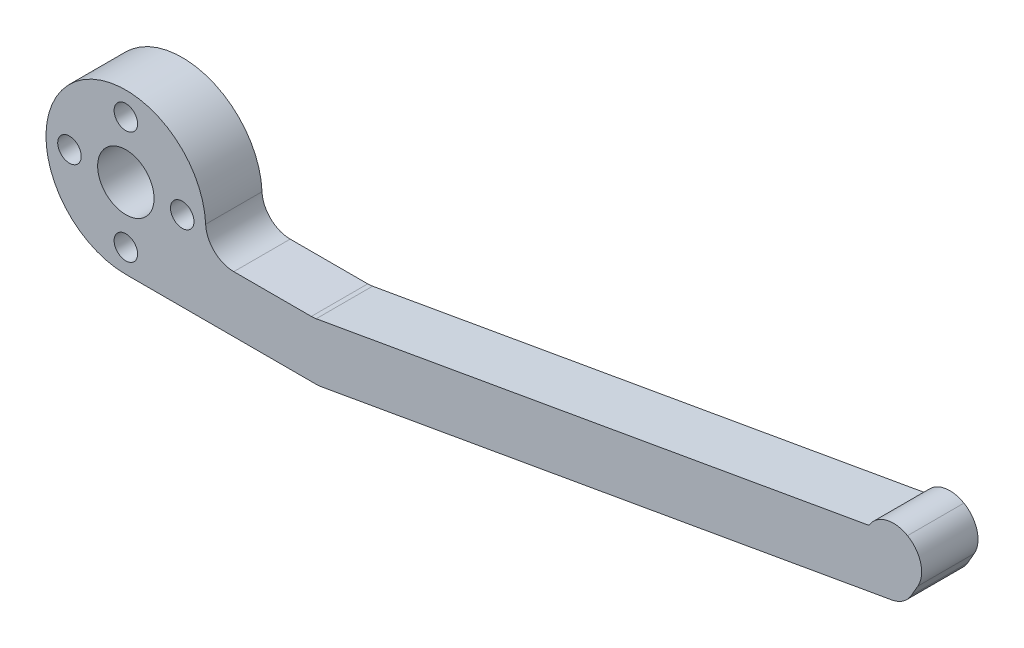
ISO-10303-21;
HEADER;
FILE_DESCRIPTION(('STEP AP214'),'2;1');
FILE_NAME('part.step','',(''),(''),'','','');
FILE_SCHEMA(('AUTOMOTIVE_DESIGN { 1 0 10303 214 1 1 1 1 }'));
ENDSEC;
DATA;
#1=APPLICATION_CONTEXT('core data for automotive mechanical design processes');
#2=APPLICATION_PROTOCOL_DEFINITION('international standard','automotive_design',2000,#1);
#3=PRODUCT_CONTEXT('',#1,'mechanical');
#4=PRODUCT('Part','Part','',(#3));
#5=PRODUCT_RELATED_PRODUCT_CATEGORY('part','',(#4));
#6=PRODUCT_DEFINITION_FORMATION('','',#4);
#7=PRODUCT_DEFINITION_CONTEXT('part definition',#1,'design');
#8=PRODUCT_DEFINITION('design','',#6,#7);
#9=PRODUCT_DEFINITION_SHAPE('','',#8);
#10=(LENGTH_UNIT() NAMED_UNIT(*) SI_UNIT(.MILLI.,.METRE.));
#11=(NAMED_UNIT(*) PLANE_ANGLE_UNIT() SI_UNIT($,.RADIAN.));
#12=(NAMED_UNIT(*) SI_UNIT($,.STERADIAN.) SOLID_ANGLE_UNIT());
#13=UNCERTAINTY_MEASURE_WITH_UNIT(LENGTH_MEASURE(1.E-05),#10,'distance_accuracy_value','');
#14=(GEOMETRIC_REPRESENTATION_CONTEXT(3) GLOBAL_UNCERTAINTY_ASSIGNED_CONTEXT((#13)) GLOBAL_UNIT_ASSIGNED_CONTEXT((#10,
#11,#12)) REPRESENTATION_CONTEXT('',''));
#15=CARTESIAN_POINT('',(0.,0.,0.));
#16=DIRECTION('',(0.,0.,1.));
#17=DIRECTION('',(1.,0.,0.));
#18=AXIS2_PLACEMENT_3D('',#15,#16,#17);
#19=CARTESIAN_POINT('',(0.,0.,6.));
#20=DIRECTION('',(0.,0.,-1.));
#21=DIRECTION('',(-1.,0.,0.));
#22=AXIS2_PLACEMENT_3D('',#19,#20,#21);
#23=CYLINDRICAL_SURFACE('',#22,8.5);
#24=CARTESIAN_POINT('',(0.,0.,6.));
#25=DIRECTION('',(0.,0.,1.));
#26=DIRECTION('',(1.,0.,0.));
#27=AXIS2_PLACEMENT_3D('',#24,#25,#26);
#28=CIRCLE('',#27,8.5);
#29=CARTESIAN_POINT('',(8.49196217314317,0.369565217391303,6.));
#30=VERTEX_POINT('',#29);
#31=CARTESIAN_POINT('',(0.,-8.5,6.));
#32=VERTEX_POINT('',#31);
#33=EDGE_CURVE('E170',#30,#32,#28,.T.);
#34=ORIENTED_EDGE('',*,*,#33,.F.);
#35=DIRECTION('',(0.,0.,-1.));
#36=VECTOR('',#35,1.);
#37=CARTESIAN_POINT('',(8.49196217314317,0.369565217391303,6.));
#38=LINE('',#37,#36);
#39=CARTESIAN_POINT('',(8.49196217314317,0.369565217391303,0.));
#40=VERTEX_POINT('',#39);
#41=EDGE_CURVE('E201',#30,#40,#38,.T.);
#42=ORIENTED_EDGE('',*,*,#41,.T.);
#43=CARTESIAN_POINT('',(0.,0.,0.));
#44=DIRECTION('',(0.,0.,1.));
#45=DIRECTION('',(1.,0.,0.));
#46=AXIS2_PLACEMENT_3D('',#43,#44,#45);
#47=CIRCLE('',#46,8.5);
#48=CARTESIAN_POINT('',(0.,-8.5,0.));
#49=VERTEX_POINT('',#48);
#50=EDGE_CURVE('E169',#40,#49,#47,.T.);
#51=ORIENTED_EDGE('',*,*,#50,.T.);
#52=DIRECTION('',(0.,0.,1.));
#53=VECTOR('',#52,1.);
#54=CARTESIAN_POINT('',(0.,-8.5,-20.8806130178211));
#55=LINE('',#54,#53);
#56=EDGE_CURVE('E161',#49,#32,#55,.T.);
#57=ORIENTED_EDGE('',*,*,#56,.T.);
#58=EDGE_LOOP('',(#34,#42,#51,#57));
#59=FACE_BOUND('',#58,.T.);
#60=ADVANCED_FACE('F33',(#59),#23,.T.);
#61=CARTESIAN_POINT('',(0.,0.,6.));
#62=DIRECTION('',(0.,0.,1.));
#63=DIRECTION('',(1.,0.,0.));
#64=AXIS2_PLACEMENT_3D('',#61,#62,#63);
#65=PLANE('',#64);
#66=CARTESIAN_POINT('',(0.,-6.,6.));
#67=DIRECTION('',(0.,0.,1.));
#68=DIRECTION('',(1.,0.,0.));
#69=AXIS2_PLACEMENT_3D('',#66,#67,#68);
#70=CIRCLE('',#69,1.25);
#71=CARTESIAN_POINT('',(1.25,-6.,6.));
#72=VERTEX_POINT('',#71);
#73=EDGE_CURVE('E429',#72,#72,#70,.T.);
#74=ORIENTED_EDGE('',*,*,#73,.F.);
#75=EDGE_LOOP('',(#74));
#76=FACE_BOUND('',#75,.T.);
#77=CARTESIAN_POINT('',(6.,0.,6.));
#78=DIRECTION('',(0.,0.,1.));
#79=DIRECTION('',(1.,0.,0.));
#80=AXIS2_PLACEMENT_3D('',#77,#78,#79);
#81=CIRCLE('',#80,1.25);
#82=CARTESIAN_POINT('',(7.25,0.,6.));
#83=VERTEX_POINT('',#82);
#84=EDGE_CURVE('E432',#83,#83,#81,.T.);
#85=ORIENTED_EDGE('',*,*,#84,.F.);
#86=EDGE_LOOP('',(#85));
#87=FACE_BOUND('',#86,.T.);
#88=CARTESIAN_POINT('',(0.,6.,6.));
#89=DIRECTION('',(0.,0.,1.));
#90=DIRECTION('',(1.,0.,0.));
#91=AXIS2_PLACEMENT_3D('',#88,#89,#90);
#92=CIRCLE('',#91,1.25);
#93=CARTESIAN_POINT('',(1.25,6.,6.));
#94=VERTEX_POINT('',#93);
#95=EDGE_CURVE('E437',#94,#94,#92,.T.);
#96=ORIENTED_EDGE('',*,*,#95,.F.);
#97=EDGE_LOOP('',(#96));
#98=FACE_BOUND('',#97,.T.);
#99=CARTESIAN_POINT('',(-6.,0.,6.));
#100=DIRECTION('',(0.,0.,1.));
#101=DIRECTION('',(1.,0.,0.));
#102=AXIS2_PLACEMENT_3D('',#99,#100,#101);
#103=CIRCLE('',#102,1.25);
#104=CARTESIAN_POINT('',(-4.75,0.,6.));
#105=VERTEX_POINT('',#104);
#106=EDGE_CURVE('E440',#105,#105,#103,.T.);
#107=ORIENTED_EDGE('',*,*,#106,.F.);
#108=EDGE_LOOP('',(#107));
#109=FACE_BOUND('',#108,.T.);
#110=CARTESIAN_POINT('',(0.,0.,6.));
#111=DIRECTION('',(0.,0.,1.));
#112=DIRECTION('',(1.,0.,0.));
#113=AXIS2_PLACEMENT_3D('',#110,#111,#112);
#114=CIRCLE('',#113,3.);
#115=CARTESIAN_POINT('',(3.,0.,6.));
#116=VERTEX_POINT('',#115);
#117=EDGE_CURVE('E234',#116,#116,#114,.T.);
#118=ORIENTED_EDGE('',*,*,#117,.F.);
#119=EDGE_LOOP('',(#118));
#120=FACE_BOUND('',#119,.T.);
#121=DIRECTION('',(1.,0.,0.));
#122=VECTOR('',#121,1.);
#123=CARTESIAN_POINT('',(0.,-8.5,6.));
#124=LINE('',#123,#122);
#125=CARTESIAN_POINT('',(20.2624659905778,-8.5,6.));
#126=VERTEX_POINT('',#125);
#127=EDGE_CURVE('E150',#32,#126,#124,.T.);
#128=ORIENTED_EDGE('',*,*,#127,.T.);
#129=CARTESIAN_POINT('',(20.2624659905778,-5.5,6.));
#130=DIRECTION('',(0.,0.,1.));
#131=DIRECTION('',(1.,0.,0.));
#132=AXIS2_PLACEMENT_3D('',#129,#130,#131);
#133=CIRCLE('',#132,3.);
#134=CARTESIAN_POINT('',(20.7834105235785,-8.45442325903663,6.));
#135=VERTEX_POINT('',#134);
#136=EDGE_CURVE('E178',#126,#135,#133,.T.);
#137=ORIENTED_EDGE('',*,*,#136,.T.);
#138=DIRECTION('',(0.984807753012209,0.173648177666924,0.));
#139=VECTOR('',#138,1.);
#140=CARTESIAN_POINT('',(80.1303542467341,2.01004414194219,6.));
#141=LINE('',#140,#139);
#142=CARTESIAN_POINT('',(81.5080244378542,2.25296456715444,6.));
#143=VERTEX_POINT('',#142);
#144=EDGE_CURVE('E145',#135,#143,#141,.T.);
#145=ORIENTED_EDGE('',*,*,#144,.T.);
#146=CARTESIAN_POINT('',(80.9870799048534,5.20738782619107,6.));
#147=DIRECTION('',(0.,0.,1.));
#148=DIRECTION('',(1.,0.,0.));
#149=AXIS2_PLACEMENT_3D('',#146,#147,#148);
#150=CIRCLE('',#149,3.);
#151=CARTESIAN_POINT('',(83.5851561162067,3.70738782619106,6.));
#152=VERTEX_POINT('',#151);
#153=EDGE_CURVE('E176',#143,#152,#150,.T.);
#154=ORIENTED_EDGE('',*,*,#153,.T.);
#155=DIRECTION('',(0.500000000000003,0.866025403784437,0.));
#156=VECTOR('',#155,1.);
#157=CARTESIAN_POINT('',(82.8856946289742,2.49588499236668,6.));
#158=LINE('',#157,#156);
#159=CARTESIAN_POINT('',(84.2846176034392,4.91889066001542,6.));
#160=VERTEX_POINT('',#159);
#161=EDGE_CURVE('E231',#152,#160,#158,.T.);
#162=ORIENTED_EDGE('',*,*,#161,.T.);
#163=CARTESIAN_POINT('',(81.6865413920859,6.41889066001543,6.));
#164=DIRECTION('',(0.,0.,1.));
#165=DIRECTION('',(1.,0.,0.));
#166=AXIS2_PLACEMENT_3D('',#163,#164,#165);
#167=CIRCLE('',#166,3.);
#168=CARTESIAN_POINT('',(83.1865413920859,9.01696687136875,6.));
#169=VERTEX_POINT('',#168);
#170=EDGE_CURVE('E129',#160,#169,#167,.T.);
#171=ORIENTED_EDGE('',*,*,#170,.T.);
#172=CARTESIAN_POINT('',(81.6865413920859,6.41889066001544,6.));
#173=DIRECTION('',(0.,0.,1.));
#174=DIRECTION('',(1.,0.,0.));
#175=AXIS2_PLACEMENT_3D('',#172,#173,#174);
#176=CIRCLE('',#175,3.);
#177=CARTESIAN_POINT('',(79.0884651807326,7.91889066001545,6.));
#178=VERTEX_POINT('',#177);
#179=EDGE_CURVE('E123',#169,#178,#176,.T.);
#180=ORIENTED_EDGE('',*,*,#179,.T.);
#181=DIRECTION('',(-0.984807753012209,-0.173648177666924,0.));
#182=VECTOR('',#181,1.);
#183=CARTESIAN_POINT('',(20.,-2.5,6.));
#184=LINE('',#183,#182);
#185=CARTESIAN_POINT('',(20.258478542423,-2.45442325903663,6.));
#186=VERTEX_POINT('',#185);
#187=EDGE_CURVE('E127',#178,#186,#184,.T.);
#188=ORIENTED_EDGE('',*,*,#187,.T.);
#189=CARTESIAN_POINT('',(19.7375340094222,0.5,6.));
#190=DIRECTION('',(0.,0.,1.));
#191=DIRECTION('',(1.,0.,0.));
#192=AXIS2_PLACEMENT_3D('',#189,#190,#191);
#193=CIRCLE('',#192,3.);
#194=CARTESIAN_POINT('',(19.7375340094222,-2.5,6.));
#195=VERTEX_POINT('',#194);
#196=EDGE_CURVE('E203',#186,#195,#193,.F.);
#197=ORIENTED_EDGE('',*,*,#196,.T.);
#198=DIRECTION('',(-1.,0.,0.));
#199=VECTOR('',#198,1.);
#200=CARTESIAN_POINT('',(20.,-2.5,6.));
#201=LINE('',#200,#199);
#202=CARTESIAN_POINT('',(11.4891252930761,-2.5,6.));
#203=VERTEX_POINT('',#202);
#204=EDGE_CURVE('E153',#195,#203,#201,.T.);
#205=ORIENTED_EDGE('',*,*,#204,.T.);
#206=CARTESIAN_POINT('',(11.4891252930761,0.499999999999998,6.));
#207=DIRECTION('',(0.,0.,1.));
#208=DIRECTION('',(1.,0.,0.));
#209=AXIS2_PLACEMENT_3D('',#206,#207,#208);
#210=CIRCLE('',#209,3.);
#211=EDGE_CURVE('E42',#203,#30,#210,.F.);
#212=ORIENTED_EDGE('',*,*,#211,.T.);
#213=ORIENTED_EDGE('',*,*,#33,.T.);
#214=EDGE_LOOP('',(#128,#137,#145,#154,#162,#171,#180,#188,#197,#205,#212,#213));
#215=FACE_BOUND('',#214,.T.);
#216=ADVANCED_FACE('F126',(#76,#87,#98,#109,#120,#215),#65,.T.);
#217=CARTESIAN_POINT('',(0.,0.,0.));
#218=DIRECTION('',(0.,0.,1.));
#219=DIRECTION('',(1.,0.,0.));
#220=AXIS2_PLACEMENT_3D('',#217,#218,#219);
#221=PLANE('',#220);
#222=CARTESIAN_POINT('',(0.,-6.,0.));
#223=DIRECTION('',(0.,0.,1.));
#224=DIRECTION('',(1.,0.,0.));
#225=AXIS2_PLACEMENT_3D('',#222,#223,#224);
#226=CIRCLE('',#225,1.25);
#227=CARTESIAN_POINT('',(1.25,-6.,0.));
#228=VERTEX_POINT('',#227);
#229=EDGE_CURVE('E227',#228,#228,#226,.T.);
#230=ORIENTED_EDGE('',*,*,#229,.T.);
#231=EDGE_LOOP('',(#230));
#232=FACE_BOUND('',#231,.T.);
#233=CARTESIAN_POINT('',(6.,0.,0.));
#234=DIRECTION('',(0.,0.,1.));
#235=DIRECTION('',(1.,0.,0.));
#236=AXIS2_PLACEMENT_3D('',#233,#234,#235);
#237=CIRCLE('',#236,1.25);
#238=CARTESIAN_POINT('',(7.25,0.,0.));
#239=VERTEX_POINT('',#238);
#240=EDGE_CURVE('E447',#239,#239,#237,.T.);
#241=ORIENTED_EDGE('',*,*,#240,.T.);
#242=EDGE_LOOP('',(#241));
#243=FACE_BOUND('',#242,.T.);
#244=CARTESIAN_POINT('',(0.,6.,0.));
#245=DIRECTION('',(0.,0.,1.));
#246=DIRECTION('',(1.,0.,0.));
#247=AXIS2_PLACEMENT_3D('',#244,#245,#246);
#248=CIRCLE('',#247,1.25);
#249=CARTESIAN_POINT('',(1.25,6.,0.));
#250=VERTEX_POINT('',#249);
#251=EDGE_CURVE('E444',#250,#250,#248,.T.);
#252=ORIENTED_EDGE('',*,*,#251,.T.);
#253=EDGE_LOOP('',(#252));
#254=FACE_BOUND('',#253,.T.);
#255=CARTESIAN_POINT('',(-6.,0.,0.));
#256=DIRECTION('',(0.,0.,1.));
#257=DIRECTION('',(1.,0.,0.));
#258=AXIS2_PLACEMENT_3D('',#255,#256,#257);
#259=CIRCLE('',#258,1.25);
#260=CARTESIAN_POINT('',(-4.75,0.,0.));
#261=VERTEX_POINT('',#260);
#262=EDGE_CURVE('E443',#261,#261,#259,.T.);
#263=ORIENTED_EDGE('',*,*,#262,.T.);
#264=EDGE_LOOP('',(#263));
#265=FACE_BOUND('',#264,.T.);
#266=CARTESIAN_POINT('',(0.,0.,0.));
#267=DIRECTION('',(0.,0.,1.));
#268=DIRECTION('',(1.,0.,0.));
#269=AXIS2_PLACEMENT_3D('',#266,#267,#268);
#270=CIRCLE('',#269,3.);
#271=CARTESIAN_POINT('',(3.,0.,0.));
#272=VERTEX_POINT('',#271);
#273=EDGE_CURVE('E238',#272,#272,#270,.T.);
#274=ORIENTED_EDGE('',*,*,#273,.T.);
#275=EDGE_LOOP('',(#274));
#276=FACE_BOUND('',#275,.T.);
#277=DIRECTION('',(0.984807753012209,0.173648177666924,0.));
#278=VECTOR('',#277,1.);
#279=CARTESIAN_POINT('',(80.1303542467341,2.01004414194219,0.));
#280=LINE('',#279,#278);
#281=CARTESIAN_POINT('',(20.7834105235785,-8.45442325903663,0.));
#282=VERTEX_POINT('',#281);
#283=CARTESIAN_POINT('',(81.5080244378542,2.25296456715444,0.));
#284=VERTEX_POINT('',#283);
#285=EDGE_CURVE('E144',#282,#284,#280,.T.);
#286=ORIENTED_EDGE('',*,*,#285,.F.);
#287=CARTESIAN_POINT('',(20.2624659905778,-5.5,0.));
#288=DIRECTION('',(0.,0.,1.));
#289=DIRECTION('',(1.,0.,0.));
#290=AXIS2_PLACEMENT_3D('',#287,#288,#289);
#291=CIRCLE('',#290,3.);
#292=CARTESIAN_POINT('',(20.2624659905778,-8.5,0.));
#293=VERTEX_POINT('',#292);
#294=EDGE_CURVE('E189',#282,#293,#291,.F.);
#295=ORIENTED_EDGE('',*,*,#294,.T.);
#296=DIRECTION('',(-1.,0.,0.));
#297=VECTOR('',#296,1.);
#298=CARTESIAN_POINT('',(0.,-8.5,0.));
#299=LINE('',#298,#297);
#300=EDGE_CURVE('E160',#293,#49,#299,.T.);
#301=ORIENTED_EDGE('',*,*,#300,.T.);
#302=ORIENTED_EDGE('',*,*,#50,.F.);
#303=CARTESIAN_POINT('',(11.4891252930761,0.499999999999998,0.));
#304=DIRECTION('',(0.,0.,1.));
#305=DIRECTION('',(1.,0.,0.));
#306=AXIS2_PLACEMENT_3D('',#303,#304,#305);
#307=CIRCLE('',#306,3.);
#308=CARTESIAN_POINT('',(11.4891252930761,-2.5,0.));
#309=VERTEX_POINT('',#308);
#310=EDGE_CURVE('E11',#40,#309,#307,.T.);
#311=ORIENTED_EDGE('',*,*,#310,.T.);
#312=DIRECTION('',(1.,0.,0.));
#313=VECTOR('',#312,1.);
#314=CARTESIAN_POINT('',(20.,-2.5,0.));
#315=LINE('',#314,#313);
#316=CARTESIAN_POINT('',(19.7375340094222,-2.5,0.));
#317=VERTEX_POINT('',#316);
#318=EDGE_CURVE('E158',#309,#317,#315,.T.);
#319=ORIENTED_EDGE('',*,*,#318,.T.);
#320=CARTESIAN_POINT('',(19.7375340094222,0.5,0.));
#321=DIRECTION('',(0.,0.,1.));
#322=DIRECTION('',(1.,0.,0.));
#323=AXIS2_PLACEMENT_3D('',#320,#321,#322);
#324=CIRCLE('',#323,3.);
#325=CARTESIAN_POINT('',(20.258478542423,-2.45442325903663,0.));
#326=VERTEX_POINT('',#325);
#327=EDGE_CURVE('E205',#317,#326,#324,.T.);
#328=ORIENTED_EDGE('',*,*,#327,.T.);
#329=DIRECTION('',(-0.984807753012209,-0.173648177666924,0.));
#330=VECTOR('',#329,1.);
#331=CARTESIAN_POINT('',(20.,-2.5,0.));
#332=LINE('',#331,#330);
#333=CARTESIAN_POINT('',(79.0884651807326,7.91889066001545,0.));
#334=VERTEX_POINT('',#333);
#335=EDGE_CURVE('E151',#334,#326,#332,.T.);
#336=ORIENTED_EDGE('',*,*,#335,.F.);
#337=CARTESIAN_POINT('',(81.6865413920859,6.41889066001544,0.));
#338=DIRECTION('',(0.,0.,1.));
#339=DIRECTION('',(1.,0.,0.));
#340=AXIS2_PLACEMENT_3D('',#337,#338,#339);
#341=CIRCLE('',#340,3.);
#342=CARTESIAN_POINT('',(83.1865413920859,9.01696687136875,0.));
#343=VERTEX_POINT('',#342);
#344=EDGE_CURVE('E149',#334,#343,#341,.F.);
#345=ORIENTED_EDGE('',*,*,#344,.T.);
#346=CARTESIAN_POINT('',(81.6865413920859,6.41889066001543,0.));
#347=DIRECTION('',(0.,0.,1.));
#348=DIRECTION('',(1.,0.,0.));
#349=AXIS2_PLACEMENT_3D('',#346,#347,#348);
#350=CIRCLE('',#349,3.);
#351=CARTESIAN_POINT('',(84.2846176034392,4.91889066001542,0.));
#352=VERTEX_POINT('',#351);
#353=EDGE_CURVE('E49',#343,#352,#350,.F.);
#354=ORIENTED_EDGE('',*,*,#353,.T.);
#355=DIRECTION('',(0.500000000000003,0.866025403784437,0.));
#356=VECTOR('',#355,1.);
#357=CARTESIAN_POINT('',(82.8856946289742,2.49588499236668,0.));
#358=LINE('',#357,#356);
#359=CARTESIAN_POINT('',(83.5851561162067,3.70738782619106,0.));
#360=VERTEX_POINT('',#359);
#361=EDGE_CURVE('E232',#360,#352,#358,.T.);
#362=ORIENTED_EDGE('',*,*,#361,.F.);
#363=CARTESIAN_POINT('',(80.9870799048534,5.20738782619107,0.));
#364=DIRECTION('',(0.,0.,1.));
#365=DIRECTION('',(1.,0.,0.));
#366=AXIS2_PLACEMENT_3D('',#363,#364,#365);
#367=CIRCLE('',#366,3.);
#368=EDGE_CURVE('E187',#360,#284,#367,.F.);
#369=ORIENTED_EDGE('',*,*,#368,.T.);
#370=EDGE_LOOP('',(#286,#295,#301,#302,#311,#319,#328,#336,#345,#354,#362,#369));
#371=FACE_BOUND('',#370,.T.);
#372=ADVANCED_FACE('F219',(#232,#243,#254,#265,#276,#371),#221,.F.);
#373=CARTESIAN_POINT('',(20.,-2.5,-20.8806130178211));
#374=DIRECTION('',(0.,1.,0.));
#375=DIRECTION('',(-1.,0.,0.));
#376=AXIS2_PLACEMENT_3D('',#373,#374,#375);
#377=PLANE('',#376);
#378=ORIENTED_EDGE('',*,*,#204,.F.);
#379=DIRECTION('',(0.,0.,1.));
#380=VECTOR('',#379,1.);
#381=CARTESIAN_POINT('',(19.7375340094222,-2.5,0.));
#382=LINE('',#381,#380);
#383=EDGE_CURVE('E199',#195,#317,#382,.F.);
#384=ORIENTED_EDGE('',*,*,#383,.T.);
#385=ORIENTED_EDGE('',*,*,#318,.F.);
#386=DIRECTION('',(0.,0.,-1.));
#387=VECTOR('',#386,1.);
#388=CARTESIAN_POINT('',(11.4891252930761,-2.5,-20.8806130178211));
#389=LINE('',#388,#387);
#390=EDGE_CURVE('E196',#309,#203,#389,.F.);
#391=ORIENTED_EDGE('',*,*,#390,.T.);
#392=EDGE_LOOP('',(#378,#384,#385,#391));
#393=FACE_BOUND('',#392,.T.);
#394=ADVANCED_FACE('F222',(#393),#377,.T.);
#395=CARTESIAN_POINT('',(0.,-8.5,-20.8806130178211));
#396=DIRECTION('',(0.,-1.,0.));
#397=DIRECTION('',(0.,0.,-1.));
#398=AXIS2_PLACEMENT_3D('',#395,#396,#397);
#399=PLANE('',#398);
#400=ORIENTED_EDGE('',*,*,#300,.F.);
#401=DIRECTION('',(0.,0.,1.));
#402=VECTOR('',#401,1.);
#403=CARTESIAN_POINT('',(20.2624659905778,-8.5,-20.8806130178211));
#404=LINE('',#403,#402);
#405=EDGE_CURVE('E134',#293,#126,#404,.T.);
#406=ORIENTED_EDGE('',*,*,#405,.T.);
#407=ORIENTED_EDGE('',*,*,#127,.F.);
#408=ORIENTED_EDGE('',*,*,#56,.F.);
#409=EDGE_LOOP('',(#400,#406,#407,#408));
#410=FACE_BOUND('',#409,.T.);
#411=ADVANCED_FACE('F253',(#410),#399,.T.);
#412=CARTESIAN_POINT('',(20.,-2.5,0.));
#413=DIRECTION('',(-0.173648177666924,0.984807753012209,0.));
#414=DIRECTION('',(-0.984807753012209,-0.173648177666924,0.));
#415=AXIS2_PLACEMENT_3D('',#412,#413,#414);
#416=PLANE('',#415);
#417=ORIENTED_EDGE('',*,*,#335,.T.);
#418=DIRECTION('',(0.,0.,1.));
#419=VECTOR('',#418,1.);
#420=CARTESIAN_POINT('',(20.258478542423,-2.45442325903663,6.));
#421=LINE('',#420,#419);
#422=EDGE_CURVE('E143',#326,#186,#421,.T.);
#423=ORIENTED_EDGE('',*,*,#422,.T.);
#424=ORIENTED_EDGE('',*,*,#187,.F.);
#425=DIRECTION('',(0.,0.,1.));
#426=VECTOR('',#425,1.);
#427=CARTESIAN_POINT('',(79.0884651807326,7.91889066001545,0.));
#428=LINE('',#427,#426);
#429=EDGE_CURVE('E140',#334,#178,#428,.T.);
#430=ORIENTED_EDGE('',*,*,#429,.F.);
#431=EDGE_LOOP('',(#417,#423,#424,#430));
#432=FACE_BOUND('',#431,.T.);
#433=ADVANCED_FACE('F139',(#432),#416,.T.);
#434=CARTESIAN_POINT('',(80.1303542467341,2.01004414194219,0.));
#435=DIRECTION('',(0.173648177666924,-0.984807753012209,0.));
#436=DIRECTION('',(0.984807753012209,0.173648177666924,0.));
#437=AXIS2_PLACEMENT_3D('',#434,#435,#436);
#438=PLANE('',#437);
#439=ORIENTED_EDGE('',*,*,#144,.F.);
#440=DIRECTION('',(0.,0.,1.));
#441=VECTOR('',#440,1.);
#442=CARTESIAN_POINT('',(20.7834105235785,-8.45442325903663,0.));
#443=LINE('',#442,#441);
#444=EDGE_CURVE('E183',#135,#282,#443,.F.);
#445=ORIENTED_EDGE('',*,*,#444,.T.);
#446=ORIENTED_EDGE('',*,*,#285,.T.);
#447=DIRECTION('',(0.,0.,1.));
#448=VECTOR('',#447,1.);
#449=CARTESIAN_POINT('',(81.5080244378542,2.25296456715444,0.));
#450=LINE('',#449,#448);
#451=EDGE_CURVE('E180',#284,#143,#450,.T.);
#452=ORIENTED_EDGE('',*,*,#451,.T.);
#453=EDGE_LOOP('',(#439,#445,#446,#452));
#454=FACE_BOUND('',#453,.T.);
#455=ADVANCED_FACE('F245',(#454),#438,.T.);
#456=CARTESIAN_POINT('',(82.8856946289742,2.49588499236668,0.));
#457=DIRECTION('',(0.866025403784437,-0.500000000000003,0.));
#458=DIRECTION('',(0.500000000000003,0.866025403784437,0.));
#459=AXIS2_PLACEMENT_3D('',#456,#457,#458);
#460=PLANE('',#459);
#461=ORIENTED_EDGE('',*,*,#161,.F.);
#462=DIRECTION('',(0.,0.,1.));
#463=VECTOR('',#462,1.);
#464=CARTESIAN_POINT('',(83.5851561162067,3.70738782619106,0.));
#465=LINE('',#464,#463);
#466=EDGE_CURVE('E56',#152,#360,#465,.F.);
#467=ORIENTED_EDGE('',*,*,#466,.T.);
#468=ORIENTED_EDGE('',*,*,#361,.T.);
#469=DIRECTION('',(0.,0.,1.));
#470=VECTOR('',#469,1.);
#471=CARTESIAN_POINT('',(84.2846176034392,4.91889066001542,0.));
#472=LINE('',#471,#470);
#473=EDGE_CURVE('E191',#352,#160,#472,.T.);
#474=ORIENTED_EDGE('',*,*,#473,.T.);
#475=EDGE_LOOP('',(#461,#467,#468,#474));
#476=FACE_BOUND('',#475,.T.);
#477=ADVANCED_FACE('F230',(#476),#460,.T.);
#478=CARTESIAN_POINT('',(0.,0.,0.));
#479=DIRECTION('',(0.,0.,1.));
#480=DIRECTION('',(1.,0.,0.));
#481=AXIS2_PLACEMENT_3D('',#478,#479,#480);
#482=CYLINDRICAL_SURFACE('',#481,3.);
#483=ORIENTED_EDGE('',*,*,#117,.T.);
#484=EDGE_LOOP('',(#483));
#485=FACE_BOUND('',#484,.T.);
#486=ORIENTED_EDGE('',*,*,#273,.F.);
#487=EDGE_LOOP('',(#486));
#488=FACE_BOUND('',#487,.T.);
#489=ADVANCED_FACE('F326',(#485,#488),#482,.F.);
#490=CARTESIAN_POINT('',(-6.,0.,0.));
#491=DIRECTION('',(0.,0.,1.));
#492=DIRECTION('',(1.,0.,0.));
#493=AXIS2_PLACEMENT_3D('',#490,#491,#492);
#494=CYLINDRICAL_SURFACE('',#493,1.25);
#495=ORIENTED_EDGE('',*,*,#106,.T.);
#496=EDGE_LOOP('',(#495));
#497=FACE_BOUND('',#496,.T.);
#498=ORIENTED_EDGE('',*,*,#262,.F.);
#499=EDGE_LOOP('',(#498));
#500=FACE_BOUND('',#499,.T.);
#501=ADVANCED_FACE('F403',(#497,#500),#494,.F.);
#502=CARTESIAN_POINT('',(0.,6.,0.));
#503=DIRECTION('',(0.,0.,1.));
#504=DIRECTION('',(1.,0.,0.));
#505=AXIS2_PLACEMENT_3D('',#502,#503,#504);
#506=CYLINDRICAL_SURFACE('',#505,1.25);
#507=ORIENTED_EDGE('',*,*,#95,.T.);
#508=EDGE_LOOP('',(#507));
#509=FACE_BOUND('',#508,.T.);
#510=ORIENTED_EDGE('',*,*,#251,.F.);
#511=EDGE_LOOP('',(#510));
#512=FACE_BOUND('',#511,.T.);
#513=ADVANCED_FACE('F393',(#509,#512),#506,.F.);
#514=CARTESIAN_POINT('',(6.,0.,0.));
#515=DIRECTION('',(0.,0.,1.));
#516=DIRECTION('',(1.,0.,0.));
#517=AXIS2_PLACEMENT_3D('',#514,#515,#516);
#518=CYLINDRICAL_SURFACE('',#517,1.25);
#519=ORIENTED_EDGE('',*,*,#84,.T.);
#520=EDGE_LOOP('',(#519));
#521=FACE_BOUND('',#520,.T.);
#522=ORIENTED_EDGE('',*,*,#240,.F.);
#523=EDGE_LOOP('',(#522));
#524=FACE_BOUND('',#523,.T.);
#525=ADVANCED_FACE('F383',(#521,#524),#518,.F.);
#526=CARTESIAN_POINT('',(0.,-6.,0.));
#527=DIRECTION('',(0.,0.,1.));
#528=DIRECTION('',(1.,0.,0.));
#529=AXIS2_PLACEMENT_3D('',#526,#527,#528);
#530=CYLINDRICAL_SURFACE('',#529,1.25);
#531=ORIENTED_EDGE('',*,*,#73,.T.);
#532=EDGE_LOOP('',(#531));
#533=FACE_BOUND('',#532,.T.);
#534=ORIENTED_EDGE('',*,*,#229,.F.);
#535=EDGE_LOOP('',(#534));
#536=FACE_BOUND('',#535,.T.);
#537=ADVANCED_FACE('F274',(#533,#536),#530,.F.);
#538=CARTESIAN_POINT('',(20.2624659905778,-5.5,-20.8806130178211));
#539=DIRECTION('',(0.,0.,1.));
#540=DIRECTION('',(1.,0.,0.));
#541=AXIS2_PLACEMENT_3D('',#538,#539,#540);
#542=CYLINDRICAL_SURFACE('',#541,3.);
#543=ORIENTED_EDGE('',*,*,#294,.F.);
#544=ORIENTED_EDGE('',*,*,#444,.F.);
#545=ORIENTED_EDGE('',*,*,#136,.F.);
#546=ORIENTED_EDGE('',*,*,#405,.F.);
#547=EDGE_LOOP('',(#543,#544,#545,#546));
#548=FACE_BOUND('',#547,.T.);
#549=ADVANCED_FACE('F249',(#548),#542,.T.);
#550=CARTESIAN_POINT('',(80.9870799048534,5.20738782619107,0.));
#551=DIRECTION('',(0.,0.,1.));
#552=DIRECTION('',(1.,0.,0.));
#553=AXIS2_PLACEMENT_3D('',#550,#551,#552);
#554=CYLINDRICAL_SURFACE('',#553,3.);
#555=ORIENTED_EDGE('',*,*,#368,.F.);
#556=ORIENTED_EDGE('',*,*,#466,.F.);
#557=ORIENTED_EDGE('',*,*,#153,.F.);
#558=ORIENTED_EDGE('',*,*,#451,.F.);
#559=EDGE_LOOP('',(#555,#556,#557,#558));
#560=FACE_BOUND('',#559,.T.);
#561=ADVANCED_FACE('F273',(#560),#554,.T.);
#562=CARTESIAN_POINT('',(81.6865413920859,6.41889066001544,0.));
#563=DIRECTION('',(0.,0.,1.));
#564=DIRECTION('',(1.,0.,0.));
#565=AXIS2_PLACEMENT_3D('',#562,#563,#564);
#566=CYLINDRICAL_SURFACE('',#565,3.);
#567=DIRECTION('',(0.,0.,1.));
#568=VECTOR('',#567,1.);
#569=CARTESIAN_POINT('',(83.1865413920859,9.01696687136875,0.));
#570=LINE('',#569,#568);
#571=EDGE_CURVE('E37',#343,#169,#570,.T.);
#572=ORIENTED_EDGE('',*,*,#571,.F.);
#573=ORIENTED_EDGE('',*,*,#344,.F.);
#574=ORIENTED_EDGE('',*,*,#429,.T.);
#575=ORIENTED_EDGE('',*,*,#179,.F.);
#576=EDGE_LOOP('',(#572,#573,#574,#575));
#577=FACE_BOUND('',#576,.T.);
#578=ADVANCED_FACE('F148',(#577),#566,.T.);
#579=CARTESIAN_POINT('',(81.6865413920859,6.41889066001543,0.));
#580=DIRECTION('',(0.,0.,1.));
#581=DIRECTION('',(1.,0.,0.));
#582=AXIS2_PLACEMENT_3D('',#579,#580,#581);
#583=CYLINDRICAL_SURFACE('',#582,3.);
#584=ORIENTED_EDGE('',*,*,#353,.F.);
#585=ORIENTED_EDGE('',*,*,#571,.T.);
#586=ORIENTED_EDGE('',*,*,#170,.F.);
#587=ORIENTED_EDGE('',*,*,#473,.F.);
#588=EDGE_LOOP('',(#584,#585,#586,#587));
#589=FACE_BOUND('',#588,.T.);
#590=ADVANCED_FACE('F229',(#589),#583,.T.);
#591=CARTESIAN_POINT('',(19.7375340094222,0.5,0.));
#592=DIRECTION('',(0.,0.,-1.));
#593=DIRECTION('',(-1.,0.,0.));
#594=AXIS2_PLACEMENT_3D('',#591,#592,#593);
#595=CYLINDRICAL_SURFACE('',#594,3.);
#596=ORIENTED_EDGE('',*,*,#327,.F.);
#597=ORIENTED_EDGE('',*,*,#383,.F.);
#598=ORIENTED_EDGE('',*,*,#196,.F.);
#599=ORIENTED_EDGE('',*,*,#422,.F.);
#600=EDGE_LOOP('',(#596,#597,#598,#599));
#601=FACE_BOUND('',#600,.T.);
#602=ADVANCED_FACE('F225',(#601),#595,.F.);
#603=CARTESIAN_POINT('',(11.4891252930761,0.499999999999998,6.));
#604=DIRECTION('',(0.,0.,-1.));
#605=DIRECTION('',(-1.,0.,0.));
#606=AXIS2_PLACEMENT_3D('',#603,#604,#605);
#607=CYLINDRICAL_SURFACE('',#606,3.);
#608=ORIENTED_EDGE('',*,*,#310,.F.);
#609=ORIENTED_EDGE('',*,*,#41,.F.);
#610=ORIENTED_EDGE('',*,*,#211,.F.);
#611=ORIENTED_EDGE('',*,*,#390,.F.);
#612=EDGE_LOOP('',(#608,#609,#610,#611));
#613=FACE_BOUND('',#612,.T.);
#614=ADVANCED_FACE('F35',(#613),#607,.F.);
#615=CLOSED_SHELL('',(#60,#216,#372,#394,#411,#433,#455,#477,#489,#501,#513,#525,#537,#549,#561,
#578,#590,#602,#614));
#616=MANIFOLD_SOLID_BREP('B2',#615);
#617=ADVANCED_BREP_SHAPE_REPRESENTATION('',(#18,#616),#14);
#618=SHAPE_DEFINITION_REPRESENTATION(#9,#617);
ENDSEC;
END-ISO-10303-21;
